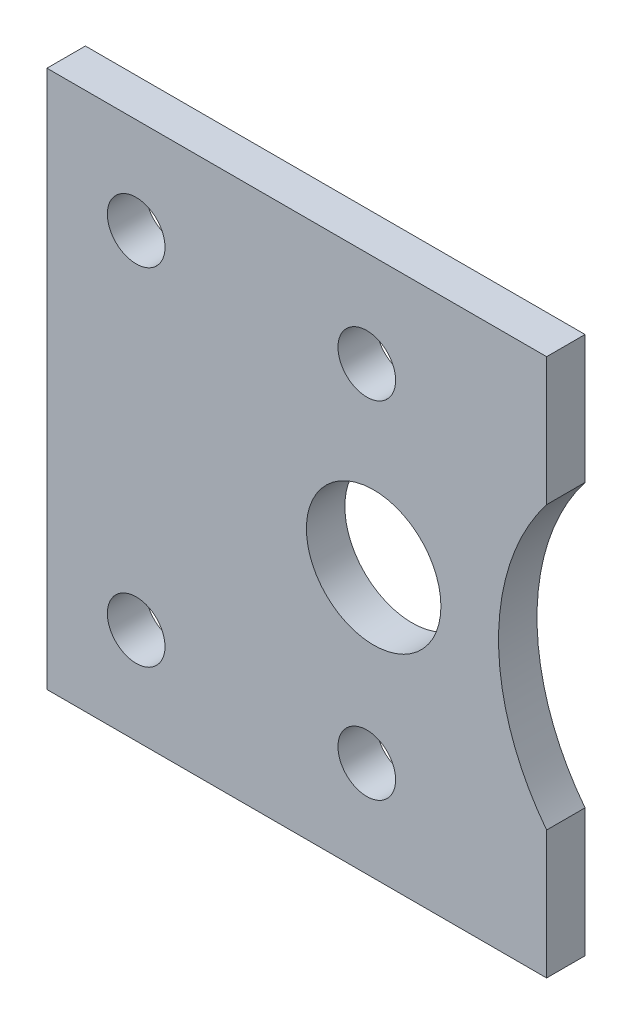
ISO-10303-21;
HEADER;
FILE_DESCRIPTION(('STEP AP214'),'2;1');
FILE_NAME('part.step','',(''),(''),'','','');
FILE_SCHEMA(('AUTOMOTIVE_DESIGN { 1 0 10303 214 1 1 1 1 }'));
ENDSEC;
DATA;
#1=APPLICATION_CONTEXT('core data for automotive mechanical design processes');
#2=APPLICATION_PROTOCOL_DEFINITION('international standard','automotive_design',2000,#1);
#3=PRODUCT_CONTEXT('',#1,'mechanical');
#4=PRODUCT('Part','Part','',(#3));
#5=PRODUCT_RELATED_PRODUCT_CATEGORY('part','',(#4));
#6=PRODUCT_DEFINITION_FORMATION('','',#4);
#7=PRODUCT_DEFINITION_CONTEXT('part definition',#1,'design');
#8=PRODUCT_DEFINITION('design','',#6,#7);
#9=PRODUCT_DEFINITION_SHAPE('','',#8);
#10=(LENGTH_UNIT() NAMED_UNIT(*) SI_UNIT(.MILLI.,.METRE.));
#11=(NAMED_UNIT(*) PLANE_ANGLE_UNIT() SI_UNIT($,.RADIAN.));
#12=(NAMED_UNIT(*) SI_UNIT($,.STERADIAN.) SOLID_ANGLE_UNIT());
#13=UNCERTAINTY_MEASURE_WITH_UNIT(LENGTH_MEASURE(1.E-05),#10,'distance_accuracy_value','');
#14=(GEOMETRIC_REPRESENTATION_CONTEXT(3) GLOBAL_UNCERTAINTY_ASSIGNED_CONTEXT((#13)) GLOBAL_UNIT_ASSIGNED_CONTEXT((#10,
#11,#12)) REPRESENTATION_CONTEXT('',''));
#15=CARTESIAN_POINT('',(0.,0.,0.));
#16=DIRECTION('',(0.,0.,1.));
#17=DIRECTION('',(1.,0.,0.));
#18=AXIS2_PLACEMENT_3D('',#15,#16,#17);
#19=CARTESIAN_POINT('',(22.5,0.,2.));
#20=DIRECTION('',(0.,0.,1.));
#21=DIRECTION('',(1.,0.,0.));
#22=AXIS2_PLACEMENT_3D('',#19,#20,#21);
#23=PLANE('',#22);
#24=CARTESIAN_POINT('',(3.64285714285733,-9.,2.));
#25=DIRECTION('',(0.,0.,1.));
#26=DIRECTION('',(1.,0.,0.));
#27=AXIS2_PLACEMENT_3D('',#24,#25,#26);
#28=CIRCLE('',#27,1.5);
#29=CARTESIAN_POINT('',(5.14285714285733,-9.,2.));
#30=VERTEX_POINT('',#29);
#31=EDGE_CURVE('E220',#30,#30,#28,.T.);
#32=ORIENTED_EDGE('',*,*,#31,.F.);
#33=EDGE_LOOP('',(#32));
#34=FACE_BOUND('',#33,.T.);
#35=CARTESIAN_POINT('',(4.,0.,2.));
#36=DIRECTION('',(0.,0.,1.));
#37=DIRECTION('',(1.,0.,0.));
#38=AXIS2_PLACEMENT_3D('',#35,#36,#37);
#39=CIRCLE('',#38,3.5);
#40=CARTESIAN_POINT('',(7.5,0.,2.));
#41=VERTEX_POINT('',#40);
#42=EDGE_CURVE('E236',#41,#41,#39,.T.);
#43=ORIENTED_EDGE('',*,*,#42,.F.);
#44=EDGE_LOOP('',(#43));
#45=FACE_BOUND('',#44,.T.);
#46=DIRECTION('',(0.,1.,0.));
#47=VECTOR('',#46,1.);
#48=CARTESIAN_POINT('',(13.,7.33143914930759,2.));
#49=LINE('',#48,#47);
#50=CARTESIAN_POINT('',(13.,7.33143914930759,2.));
#51=VERTEX_POINT('',#50);
#52=CARTESIAN_POINT('',(13.,14.,2.));
#53=VERTEX_POINT('',#52);
#54=EDGE_CURVE('E150',#51,#53,#49,.T.);
#55=ORIENTED_EDGE('',*,*,#54,.T.);
#56=DIRECTION('',(-1.,0.,0.));
#57=VECTOR('',#56,1.);
#58=CARTESIAN_POINT('',(-13.,14.,2.));
#59=LINE('',#58,#57);
#60=CARTESIAN_POINT('',(-13.,14.,2.));
#61=VERTEX_POINT('',#60);
#62=EDGE_CURVE('E98',#53,#61,#59,.T.);
#63=ORIENTED_EDGE('',*,*,#62,.T.);
#64=DIRECTION('',(0.,-1.,0.));
#65=VECTOR('',#64,1.);
#66=CARTESIAN_POINT('',(-13.,-14.,2.));
#67=LINE('',#66,#65);
#68=CARTESIAN_POINT('',(-13.,-14.,2.));
#69=VERTEX_POINT('',#68);
#70=EDGE_CURVE('E111',#61,#69,#67,.T.);
#71=ORIENTED_EDGE('',*,*,#70,.T.);
#72=DIRECTION('',(1.,0.,0.));
#73=VECTOR('',#72,1.);
#74=CARTESIAN_POINT('',(-13.,-14.,2.));
#75=LINE('',#74,#73);
#76=CARTESIAN_POINT('',(13.,-14.,2.));
#77=VERTEX_POINT('',#76);
#78=EDGE_CURVE('E105',#69,#77,#75,.T.);
#79=ORIENTED_EDGE('',*,*,#78,.T.);
#80=DIRECTION('',(0.,1.,0.));
#81=VECTOR('',#80,1.);
#82=CARTESIAN_POINT('',(13.,-14.,2.));
#83=LINE('',#82,#81);
#84=CARTESIAN_POINT('',(13.,-7.33143914930759,2.));
#85=VERTEX_POINT('',#84);
#86=EDGE_CURVE('E109',#77,#85,#83,.T.);
#87=ORIENTED_EDGE('',*,*,#86,.T.);
#88=CARTESIAN_POINT('',(22.5,0.,2.));
#89=DIRECTION('',(0.,0.,-1.));
#90=DIRECTION('',(1.,0.,0.));
#91=AXIS2_PLACEMENT_3D('',#88,#89,#90);
#92=CIRCLE('',#91,12.);
#93=EDGE_CURVE('E61',#85,#51,#92,.T.);
#94=ORIENTED_EDGE('',*,*,#93,.T.);
#95=EDGE_LOOP('',(#55,#63,#71,#79,#87,#94));
#96=FACE_BOUND('',#95,.T.);
#97=CARTESIAN_POINT('',(-8.35714285714286,9.,2.));
#98=DIRECTION('',(0.,0.,1.));
#99=DIRECTION('',(1.,0.,0.));
#100=AXIS2_PLACEMENT_3D('',#97,#98,#99);
#101=CIRCLE('',#100,1.5);
#102=CARTESIAN_POINT('',(-6.85714285714286,9.,2.));
#103=VERTEX_POINT('',#102);
#104=EDGE_CURVE('E138',#103,#103,#101,.T.);
#105=ORIENTED_EDGE('',*,*,#104,.F.);
#106=EDGE_LOOP('',(#105));
#107=FACE_BOUND('',#106,.T.);
#108=CARTESIAN_POINT('',(3.64285714285714,9.,2.));
#109=DIRECTION('',(0.,0.,1.));
#110=DIRECTION('',(1.,0.,0.));
#111=AXIS2_PLACEMENT_3D('',#108,#109,#110);
#112=CIRCLE('',#111,1.5);
#113=CARTESIAN_POINT('',(5.14285714285714,9.,2.));
#114=VERTEX_POINT('',#113);
#115=EDGE_CURVE('E228',#114,#114,#112,.T.);
#116=ORIENTED_EDGE('',*,*,#115,.F.);
#117=EDGE_LOOP('',(#116));
#118=FACE_BOUND('',#117,.T.);
#119=CARTESIAN_POINT('',(-8.35714285714267,-9.,2.));
#120=DIRECTION('',(0.,0.,1.));
#121=DIRECTION('',(1.,0.,0.));
#122=AXIS2_PLACEMENT_3D('',#119,#120,#121);
#123=CIRCLE('',#122,1.5);
#124=CARTESIAN_POINT('',(-6.85714285714267,-9.,2.));
#125=VERTEX_POINT('',#124);
#126=EDGE_CURVE('E209',#125,#125,#123,.T.);
#127=ORIENTED_EDGE('',*,*,#126,.F.);
#128=EDGE_LOOP('',(#127));
#129=FACE_BOUND('',#128,.T.);
#130=ADVANCED_FACE('F43',(#34,#45,#96,#107,#118,#129),#23,.T.);
#131=CARTESIAN_POINT('',(22.5,0.,0.));
#132=DIRECTION('',(0.,0.,1.));
#133=DIRECTION('',(1.,0.,0.));
#134=AXIS2_PLACEMENT_3D('',#131,#132,#133);
#135=PLANE('',#134);
#136=DIRECTION('',(0.,1.,0.));
#137=VECTOR('',#136,1.);
#138=CARTESIAN_POINT('',(13.,7.33143914930759,0.));
#139=LINE('',#138,#137);
#140=CARTESIAN_POINT('',(13.,7.33143914930759,0.));
#141=VERTEX_POINT('',#140);
#142=CARTESIAN_POINT('',(13.,14.,0.));
#143=VERTEX_POINT('',#142);
#144=EDGE_CURVE('E133',#141,#143,#139,.T.);
#145=ORIENTED_EDGE('',*,*,#144,.F.);
#146=CARTESIAN_POINT('',(22.5,0.,0.));
#147=DIRECTION('',(0.,0.,-1.));
#148=DIRECTION('',(1.,0.,0.));
#149=AXIS2_PLACEMENT_3D('',#146,#147,#148);
#150=CIRCLE('',#149,12.);
#151=CARTESIAN_POINT('',(13.,-7.33143914930759,0.));
#152=VERTEX_POINT('',#151);
#153=EDGE_CURVE('E90',#152,#141,#150,.T.);
#154=ORIENTED_EDGE('',*,*,#153,.F.);
#155=DIRECTION('',(0.,1.,0.));
#156=VECTOR('',#155,1.);
#157=CARTESIAN_POINT('',(13.,-14.,0.));
#158=LINE('',#157,#156);
#159=CARTESIAN_POINT('',(13.,-14.,0.));
#160=VERTEX_POINT('',#159);
#161=EDGE_CURVE('E84',#160,#152,#158,.T.);
#162=ORIENTED_EDGE('',*,*,#161,.F.);
#163=DIRECTION('',(1.,0.,0.));
#164=VECTOR('',#163,1.);
#165=CARTESIAN_POINT('',(-13.,-14.,0.));
#166=LINE('',#165,#164);
#167=CARTESIAN_POINT('',(-13.,-14.,0.));
#168=VERTEX_POINT('',#167);
#169=EDGE_CURVE('E120',#168,#160,#166,.T.);
#170=ORIENTED_EDGE('',*,*,#169,.F.);
#171=DIRECTION('',(0.,-1.,0.));
#172=VECTOR('',#171,1.);
#173=CARTESIAN_POINT('',(-13.,-14.,0.));
#174=LINE('',#173,#172);
#175=CARTESIAN_POINT('',(-13.,14.,0.));
#176=VERTEX_POINT('',#175);
#177=EDGE_CURVE('E141',#176,#168,#174,.T.);
#178=ORIENTED_EDGE('',*,*,#177,.F.);
#179=DIRECTION('',(-1.,0.,0.));
#180=VECTOR('',#179,1.);
#181=CARTESIAN_POINT('',(-13.,14.,0.));
#182=LINE('',#181,#180);
#183=EDGE_CURVE('E137',#143,#176,#182,.T.);
#184=ORIENTED_EDGE('',*,*,#183,.F.);
#185=EDGE_LOOP('',(#145,#154,#162,#170,#178,#184));
#186=FACE_BOUND('',#185,.T.);
#187=CARTESIAN_POINT('',(-8.35714285714286,9.,0.));
#188=DIRECTION('',(0.,0.,1.));
#189=DIRECTION('',(1.,0.,0.));
#190=AXIS2_PLACEMENT_3D('',#187,#188,#189);
#191=CIRCLE('',#190,1.5);
#192=CARTESIAN_POINT('',(-6.85714285714286,9.,0.));
#193=VERTEX_POINT('',#192);
#194=EDGE_CURVE('E240',#193,#193,#191,.T.);
#195=ORIENTED_EDGE('',*,*,#194,.T.);
#196=EDGE_LOOP('',(#195));
#197=FACE_BOUND('',#196,.T.);
#198=CARTESIAN_POINT('',(4.,0.,0.));
#199=DIRECTION('',(0.,0.,1.));
#200=DIRECTION('',(1.,0.,0.));
#201=AXIS2_PLACEMENT_3D('',#198,#199,#200);
#202=CIRCLE('',#201,3.5);
#203=CARTESIAN_POINT('',(7.5,0.,0.));
#204=VERTEX_POINT('',#203);
#205=EDGE_CURVE('E232',#204,#204,#202,.T.);
#206=ORIENTED_EDGE('',*,*,#205,.T.);
#207=EDGE_LOOP('',(#206));
#208=FACE_BOUND('',#207,.T.);
#209=CARTESIAN_POINT('',(3.64285714285714,9.,0.));
#210=DIRECTION('',(0.,0.,1.));
#211=DIRECTION('',(1.,0.,0.));
#212=AXIS2_PLACEMENT_3D('',#209,#210,#211);
#213=CIRCLE('',#212,1.5);
#214=CARTESIAN_POINT('',(5.14285714285714,9.,0.));
#215=VERTEX_POINT('',#214);
#216=EDGE_CURVE('E224',#215,#215,#213,.T.);
#217=ORIENTED_EDGE('',*,*,#216,.T.);
#218=EDGE_LOOP('',(#217));
#219=FACE_BOUND('',#218,.T.);
#220=CARTESIAN_POINT('',(3.64285714285733,-9.,0.));
#221=DIRECTION('',(0.,0.,1.));
#222=DIRECTION('',(1.,0.,0.));
#223=AXIS2_PLACEMENT_3D('',#220,#221,#222);
#224=CIRCLE('',#223,1.5);
#225=CARTESIAN_POINT('',(5.14285714285733,-9.,0.));
#226=VERTEX_POINT('',#225);
#227=EDGE_CURVE('E217',#226,#226,#224,.T.);
#228=ORIENTED_EDGE('',*,*,#227,.T.);
#229=EDGE_LOOP('',(#228));
#230=FACE_BOUND('',#229,.T.);
#231=CARTESIAN_POINT('',(-8.35714285714267,-9.,0.));
#232=DIRECTION('',(0.,0.,1.));
#233=DIRECTION('',(1.,0.,0.));
#234=AXIS2_PLACEMENT_3D('',#231,#232,#233);
#235=CIRCLE('',#234,1.5);
#236=CARTESIAN_POINT('',(-6.85714285714267,-9.,0.));
#237=VERTEX_POINT('',#236);
#238=EDGE_CURVE('E212',#237,#237,#235,.T.);
#239=ORIENTED_EDGE('',*,*,#238,.T.);
#240=EDGE_LOOP('',(#239));
#241=FACE_BOUND('',#240,.T.);
#242=ADVANCED_FACE('F163',(#186,#197,#208,#219,#230,#241),#135,.F.);
#243=CARTESIAN_POINT('',(13.,7.33143914930759,2.));
#244=DIRECTION('',(-1.,0.,0.));
#245=DIRECTION('',(0.,0.,1.));
#246=AXIS2_PLACEMENT_3D('',#243,#244,#245);
#247=PLANE('',#246);
#248=ORIENTED_EDGE('',*,*,#144,.T.);
#249=DIRECTION('',(0.,0.,-1.));
#250=VECTOR('',#249,1.);
#251=CARTESIAN_POINT('',(13.,14.,2.));
#252=LINE('',#251,#250);
#253=EDGE_CURVE('E11',#53,#143,#252,.T.);
#254=ORIENTED_EDGE('',*,*,#253,.F.);
#255=ORIENTED_EDGE('',*,*,#54,.F.);
#256=DIRECTION('',(0.,0.,-1.));
#257=VECTOR('',#256,1.);
#258=CARTESIAN_POINT('',(13.,7.33143914930759,2.));
#259=LINE('',#258,#257);
#260=EDGE_CURVE('E129',#51,#141,#259,.T.);
#261=ORIENTED_EDGE('',*,*,#260,.T.);
#262=EDGE_LOOP('',(#248,#254,#255,#261));
#263=FACE_BOUND('',#262,.T.);
#264=ADVANCED_FACE('F45',(#263),#247,.F.);
#265=CARTESIAN_POINT('',(-13.,14.,2.));
#266=DIRECTION('',(0.,-1.,0.));
#267=DIRECTION('',(0.,0.,-1.));
#268=AXIS2_PLACEMENT_3D('',#265,#266,#267);
#269=PLANE('',#268);
#270=ORIENTED_EDGE('',*,*,#183,.T.);
#271=DIRECTION('',(0.,0.,-1.));
#272=VECTOR('',#271,1.);
#273=CARTESIAN_POINT('',(-13.,14.,2.));
#274=LINE('',#273,#272);
#275=EDGE_CURVE('E53',#61,#176,#274,.T.);
#276=ORIENTED_EDGE('',*,*,#275,.F.);
#277=ORIENTED_EDGE('',*,*,#62,.F.);
#278=ORIENTED_EDGE('',*,*,#253,.T.);
#279=EDGE_LOOP('',(#270,#276,#277,#278));
#280=FACE_BOUND('',#279,.T.);
#281=ADVANCED_FACE('F317',(#280),#269,.F.);
#282=CARTESIAN_POINT('',(-13.,-14.,2.));
#283=DIRECTION('',(1.,0.,0.));
#284=DIRECTION('',(0.,0.,-1.));
#285=AXIS2_PLACEMENT_3D('',#282,#283,#284);
#286=PLANE('',#285);
#287=ORIENTED_EDGE('',*,*,#177,.T.);
#288=DIRECTION('',(0.,0.,-1.));
#289=VECTOR('',#288,1.);
#290=CARTESIAN_POINT('',(-13.,-14.,2.));
#291=LINE('',#290,#289);
#292=EDGE_CURVE('E122',#69,#168,#291,.T.);
#293=ORIENTED_EDGE('',*,*,#292,.F.);
#294=ORIENTED_EDGE('',*,*,#70,.F.);
#295=ORIENTED_EDGE('',*,*,#275,.T.);
#296=EDGE_LOOP('',(#287,#293,#294,#295));
#297=FACE_BOUND('',#296,.T.);
#298=ADVANCED_FACE('F160',(#297),#286,.F.);
#299=CARTESIAN_POINT('',(-13.,-14.,2.));
#300=DIRECTION('',(0.,1.,0.));
#301=DIRECTION('',(0.,0.,1.));
#302=AXIS2_PLACEMENT_3D('',#299,#300,#301);
#303=PLANE('',#302);
#304=ORIENTED_EDGE('',*,*,#169,.T.);
#305=DIRECTION('',(0.,0.,-1.));
#306=VECTOR('',#305,1.);
#307=CARTESIAN_POINT('',(13.,-14.,2.));
#308=LINE('',#307,#306);
#309=EDGE_CURVE('E117',#77,#160,#308,.T.);
#310=ORIENTED_EDGE('',*,*,#309,.F.);
#311=ORIENTED_EDGE('',*,*,#78,.F.);
#312=ORIENTED_EDGE('',*,*,#292,.T.);
#313=EDGE_LOOP('',(#304,#310,#311,#312));
#314=FACE_BOUND('',#313,.T.);
#315=ADVANCED_FACE('F118',(#314),#303,.F.);
#316=CARTESIAN_POINT('',(13.,-14.,2.));
#317=DIRECTION('',(-1.,0.,0.));
#318=DIRECTION('',(0.,0.,1.));
#319=AXIS2_PLACEMENT_3D('',#316,#317,#318);
#320=PLANE('',#319);
#321=ORIENTED_EDGE('',*,*,#161,.T.);
#322=DIRECTION('',(0.,0.,-1.));
#323=VECTOR('',#322,1.);
#324=CARTESIAN_POINT('',(13.,-7.33143914930759,2.));
#325=LINE('',#324,#323);
#326=EDGE_CURVE('E123',#85,#152,#325,.T.);
#327=ORIENTED_EDGE('',*,*,#326,.F.);
#328=ORIENTED_EDGE('',*,*,#86,.F.);
#329=ORIENTED_EDGE('',*,*,#309,.T.);
#330=EDGE_LOOP('',(#321,#327,#328,#329));
#331=FACE_BOUND('',#330,.T.);
#332=ADVANCED_FACE('F125',(#331),#320,.F.);
#333=CARTESIAN_POINT('',(22.5,0.,2.));
#334=DIRECTION('',(0.,0.,-1.));
#335=DIRECTION('',(-1.,0.,0.));
#336=AXIS2_PLACEMENT_3D('',#333,#334,#335);
#337=CYLINDRICAL_SURFACE('',#336,12.);
#338=ORIENTED_EDGE('',*,*,#153,.T.);
#339=ORIENTED_EDGE('',*,*,#260,.F.);
#340=ORIENTED_EDGE('',*,*,#93,.F.);
#341=ORIENTED_EDGE('',*,*,#326,.T.);
#342=EDGE_LOOP('',(#338,#339,#340,#341));
#343=FACE_BOUND('',#342,.T.);
#344=ADVANCED_FACE('F168',(#343),#337,.F.);
#345=CARTESIAN_POINT('',(-8.35714285714286,9.,2.));
#346=DIRECTION('',(0.,0.,-1.));
#347=DIRECTION('',(-1.,0.,0.));
#348=AXIS2_PLACEMENT_3D('',#345,#346,#347);
#349=CYLINDRICAL_SURFACE('',#348,1.5);
#350=ORIENTED_EDGE('',*,*,#104,.T.);
#351=EDGE_LOOP('',(#350));
#352=FACE_BOUND('',#351,.T.);
#353=ORIENTED_EDGE('',*,*,#194,.F.);
#354=EDGE_LOOP('',(#353));
#355=FACE_BOUND('',#354,.T.);
#356=ADVANCED_FACE('F170',(#352,#355),#349,.F.);
#357=CARTESIAN_POINT('',(4.,0.,2.));
#358=DIRECTION('',(0.,0.,-1.));
#359=DIRECTION('',(-1.,0.,0.));
#360=AXIS2_PLACEMENT_3D('',#357,#358,#359);
#361=CYLINDRICAL_SURFACE('',#360,3.5);
#362=ORIENTED_EDGE('',*,*,#42,.T.);
#363=EDGE_LOOP('',(#362));
#364=FACE_BOUND('',#363,.T.);
#365=ORIENTED_EDGE('',*,*,#205,.F.);
#366=EDGE_LOOP('',(#365));
#367=FACE_BOUND('',#366,.T.);
#368=ADVANCED_FACE('F176',(#364,#367),#361,.F.);
#369=CARTESIAN_POINT('',(3.64285714285714,9.,2.));
#370=DIRECTION('',(0.,0.,-1.));
#371=DIRECTION('',(-1.,0.,0.));
#372=AXIS2_PLACEMENT_3D('',#369,#370,#371);
#373=CYLINDRICAL_SURFACE('',#372,1.5);
#374=ORIENTED_EDGE('',*,*,#115,.T.);
#375=EDGE_LOOP('',(#374));
#376=FACE_BOUND('',#375,.T.);
#377=ORIENTED_EDGE('',*,*,#216,.F.);
#378=EDGE_LOOP('',(#377));
#379=FACE_BOUND('',#378,.T.);
#380=ADVANCED_FACE('F192',(#376,#379),#373,.F.);
#381=CARTESIAN_POINT('',(3.64285714285733,-9.,2.));
#382=DIRECTION('',(0.,0.,-1.));
#383=DIRECTION('',(-1.,0.,0.));
#384=AXIS2_PLACEMENT_3D('',#381,#382,#383);
#385=CYLINDRICAL_SURFACE('',#384,1.5);
#386=ORIENTED_EDGE('',*,*,#31,.T.);
#387=EDGE_LOOP('',(#386));
#388=FACE_BOUND('',#387,.T.);
#389=ORIENTED_EDGE('',*,*,#227,.F.);
#390=EDGE_LOOP('',(#389));
#391=FACE_BOUND('',#390,.T.);
#392=ADVANCED_FACE('F196',(#388,#391),#385,.F.);
#393=CARTESIAN_POINT('',(-8.35714285714267,-9.,2.));
#394=DIRECTION('',(0.,0.,-1.));
#395=DIRECTION('',(-1.,0.,0.));
#396=AXIS2_PLACEMENT_3D('',#393,#394,#395);
#397=CYLINDRICAL_SURFACE('',#396,1.5);
#398=ORIENTED_EDGE('',*,*,#126,.T.);
#399=EDGE_LOOP('',(#398));
#400=FACE_BOUND('',#399,.T.);
#401=ORIENTED_EDGE('',*,*,#238,.F.);
#402=EDGE_LOOP('',(#401));
#403=FACE_BOUND('',#402,.T.);
#404=ADVANCED_FACE('F200',(#400,#403),#397,.F.);
#405=CLOSED_SHELL('',(#130,#242,#264,#281,#298,#315,#332,#344,#356,#368,#380,#392,#404));
#406=MANIFOLD_SOLID_BREP('B2',#405);
#407=ADVANCED_BREP_SHAPE_REPRESENTATION('',(#18,#406),#14);
#408=SHAPE_DEFINITION_REPRESENTATION(#9,#407);
ENDSEC;
END-ISO-10303-21;
